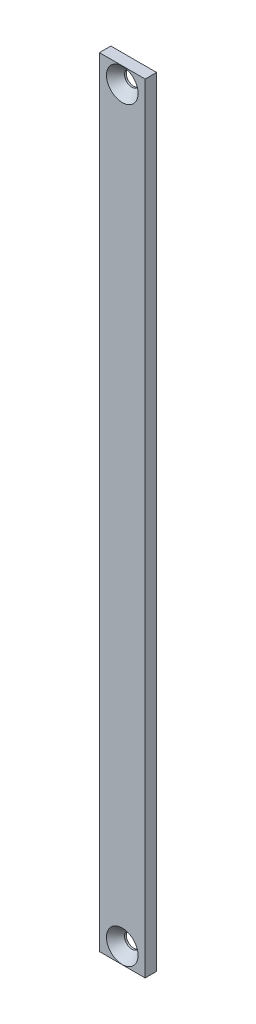
ISO-10303-21;
HEADER;
FILE_DESCRIPTION(('STEP AP214'),'2;1');
FILE_NAME('part.step','',(''),(''),'','','');
FILE_SCHEMA(('AUTOMOTIVE_DESIGN { 1 0 10303 214 1 1 1 1 }'));
ENDSEC;
DATA;
#1=APPLICATION_CONTEXT('core data for automotive mechanical design processes');
#2=APPLICATION_PROTOCOL_DEFINITION('international standard','automotive_design',2000,#1);
#3=PRODUCT_CONTEXT('',#1,'mechanical');
#4=PRODUCT('Part','Part','',(#3));
#5=PRODUCT_RELATED_PRODUCT_CATEGORY('part','',(#4));
#6=PRODUCT_DEFINITION_FORMATION('','',#4);
#7=PRODUCT_DEFINITION_CONTEXT('part definition',#1,'design');
#8=PRODUCT_DEFINITION('design','',#6,#7);
#9=PRODUCT_DEFINITION_SHAPE('','',#8);
#10=(LENGTH_UNIT() NAMED_UNIT(*) SI_UNIT(.MILLI.,.METRE.));
#11=(NAMED_UNIT(*) PLANE_ANGLE_UNIT() SI_UNIT($,.RADIAN.));
#12=(NAMED_UNIT(*) SI_UNIT($,.STERADIAN.) SOLID_ANGLE_UNIT());
#13=UNCERTAINTY_MEASURE_WITH_UNIT(LENGTH_MEASURE(1.E-05),#10,'distance_accuracy_value','');
#14=(GEOMETRIC_REPRESENTATION_CONTEXT(3) GLOBAL_UNCERTAINTY_ASSIGNED_CONTEXT((#13)) GLOBAL_UNIT_ASSIGNED_CONTEXT((#10,
#11,#12)) REPRESENTATION_CONTEXT('',''));
#15=CARTESIAN_POINT('',(0.,0.,0.));
#16=DIRECTION('',(0.,0.,1.));
#17=DIRECTION('',(1.,0.,0.));
#18=AXIS2_PLACEMENT_3D('',#15,#16,#17);
#19=CARTESIAN_POINT('',(-54.1349477888952,215.986798779334,6.35));
#20=DIRECTION('',(1.,0.,0.));
#21=DIRECTION('',(0.,1.,0.));
#22=AXIS2_PLACEMENT_3D('',#19,#20,#21);
#23=PLANE('',#22);
#24=DIRECTION('',(0.,-1.,0.));
#25=VECTOR('',#24,1.);
#26=CARTESIAN_POINT('',(-54.1349477888952,215.986798779334,0.));
#27=LINE('',#26,#25);
#28=CARTESIAN_POINT('',(-54.1349477888952,215.986798779334,0.));
#29=VERTEX_POINT('',#28);
#30=CARTESIAN_POINT('',(-54.1349477888952,-215.986798779334,0.));
#31=VERTEX_POINT('',#30);
#32=EDGE_CURVE('E73',#29,#31,#27,.T.);
#33=ORIENTED_EDGE('',*,*,#32,.T.);
#34=DIRECTION('',(0.,0.,-1.));
#35=VECTOR('',#34,1.);
#36=CARTESIAN_POINT('',(-54.1349477888952,-215.986798779334,6.35));
#37=LINE('',#36,#35);
#38=CARTESIAN_POINT('',(-54.1349477888952,-215.986798779334,6.35));
#39=VERTEX_POINT('',#38);
#40=EDGE_CURVE('E11',#39,#31,#37,.T.);
#41=ORIENTED_EDGE('',*,*,#40,.F.);
#42=DIRECTION('',(0.,-1.,0.));
#43=VECTOR('',#42,1.);
#44=CARTESIAN_POINT('',(-54.1349477888952,215.986798779334,6.35));
#45=LINE('',#44,#43);
#46=CARTESIAN_POINT('',(-54.1349477888952,215.986798779334,6.35));
#47=VERTEX_POINT('',#46);
#48=EDGE_CURVE('E96',#47,#39,#45,.T.);
#49=ORIENTED_EDGE('',*,*,#48,.F.);
#50=DIRECTION('',(0.,0.,-1.));
#51=VECTOR('',#50,1.);
#52=CARTESIAN_POINT('',(-54.1349477888952,215.986798779334,6.35));
#53=LINE('',#52,#51);
#54=EDGE_CURVE('E85',#47,#29,#53,.T.);
#55=ORIENTED_EDGE('',*,*,#54,.T.);
#56=EDGE_LOOP('',(#33,#41,#49,#55));
#57=FACE_BOUND('',#56,.T.);
#58=ADVANCED_FACE('F29',(#57),#23,.F.);
#59=CARTESIAN_POINT('',(-54.1349477888952,-215.986798779334,6.35));
#60=DIRECTION('',(0.,1.,0.));
#61=DIRECTION('',(0.,0.,1.));
#62=AXIS2_PLACEMENT_3D('',#59,#60,#61);
#63=PLANE('',#62);
#64=DIRECTION('',(1.,0.,0.));
#65=VECTOR('',#64,1.);
#66=CARTESIAN_POINT('',(-54.1349477888952,-215.986798779334,0.));
#67=LINE('',#66,#65);
#68=CARTESIAN_POINT('',(-28.7349477888952,-215.986798779334,0.));
#69=VERTEX_POINT('',#68);
#70=EDGE_CURVE('E69',#31,#69,#67,.T.);
#71=ORIENTED_EDGE('',*,*,#70,.T.);
#72=DIRECTION('',(0.,0.,-1.));
#73=VECTOR('',#72,1.);
#74=CARTESIAN_POINT('',(-28.7349477888952,-215.986798779334,6.35));
#75=LINE('',#74,#73);
#76=CARTESIAN_POINT('',(-28.7349477888952,-215.986798779334,6.35));
#77=VERTEX_POINT('',#76);
#78=EDGE_CURVE('E36',#77,#69,#75,.T.);
#79=ORIENTED_EDGE('',*,*,#78,.F.);
#80=DIRECTION('',(1.,0.,0.));
#81=VECTOR('',#80,1.);
#82=CARTESIAN_POINT('',(-54.1349477888952,-215.986798779334,6.35));
#83=LINE('',#82,#81);
#84=EDGE_CURVE('E81',#39,#77,#83,.T.);
#85=ORIENTED_EDGE('',*,*,#84,.F.);
#86=ORIENTED_EDGE('',*,*,#40,.T.);
#87=EDGE_LOOP('',(#71,#79,#85,#86));
#88=FACE_BOUND('',#87,.T.);
#89=ADVANCED_FACE('F80',(#88),#63,.F.);
#90=CARTESIAN_POINT('',(-28.7349477888951,215.986798779334,6.35));
#91=DIRECTION('',(-1.,0.,0.));
#92=DIRECTION('',(0.,-1.,0.));
#93=AXIS2_PLACEMENT_3D('',#90,#91,#92);
#94=PLANE('',#93);
#95=DIRECTION('',(0.,1.,0.));
#96=VECTOR('',#95,1.);
#97=CARTESIAN_POINT('',(-28.7349477888951,215.986798779334,0.));
#98=LINE('',#97,#96);
#99=CARTESIAN_POINT('',(-28.7349477888951,215.986798779334,0.));
#100=VERTEX_POINT('',#99);
#101=EDGE_CURVE('E74',#69,#100,#98,.T.);
#102=ORIENTED_EDGE('',*,*,#101,.T.);
#103=DIRECTION('',(0.,0.,-1.));
#104=VECTOR('',#103,1.);
#105=CARTESIAN_POINT('',(-28.7349477888951,215.986798779334,6.35));
#106=LINE('',#105,#104);
#107=CARTESIAN_POINT('',(-28.7349477888951,215.986798779334,6.35));
#108=VERTEX_POINT('',#107);
#109=EDGE_CURVE('E102',#108,#100,#106,.T.);
#110=ORIENTED_EDGE('',*,*,#109,.F.);
#111=DIRECTION('',(0.,1.,0.));
#112=VECTOR('',#111,1.);
#113=CARTESIAN_POINT('',(-28.7349477888951,215.986798779334,6.35));
#114=LINE('',#113,#112);
#115=EDGE_CURVE('E48',#77,#108,#114,.T.);
#116=ORIENTED_EDGE('',*,*,#115,.F.);
#117=ORIENTED_EDGE('',*,*,#78,.T.);
#118=EDGE_LOOP('',(#102,#110,#116,#117));
#119=FACE_BOUND('',#118,.T.);
#120=ADVANCED_FACE('F105',(#119),#94,.F.);
#121=CARTESIAN_POINT('',(-54.1349477888952,215.986798779334,6.35));
#122=DIRECTION('',(0.,-1.,0.));
#123=DIRECTION('',(0.,0.,-1.));
#124=AXIS2_PLACEMENT_3D('',#121,#122,#123);
#125=PLANE('',#124);
#126=DIRECTION('',(-1.,0.,0.));
#127=VECTOR('',#126,1.);
#128=CARTESIAN_POINT('',(-54.1349477888952,215.986798779334,0.));
#129=LINE('',#128,#127);
#130=EDGE_CURVE('E94',#100,#29,#129,.T.);
#131=ORIENTED_EDGE('',*,*,#130,.T.);
#132=ORIENTED_EDGE('',*,*,#54,.F.);
#133=DIRECTION('',(-1.,0.,0.));
#134=VECTOR('',#133,1.);
#135=CARTESIAN_POINT('',(-54.1349477888952,215.986798779334,6.35));
#136=LINE('',#135,#134);
#137=EDGE_CURVE('E43',#108,#47,#136,.T.);
#138=ORIENTED_EDGE('',*,*,#137,.F.);
#139=ORIENTED_EDGE('',*,*,#109,.T.);
#140=EDGE_LOOP('',(#131,#132,#138,#139));
#141=FACE_BOUND('',#140,.T.);
#142=ADVANCED_FACE('F107',(#141),#125,.F.);
#143=CARTESIAN_POINT('',(-54.1349477888952,215.986798779334,6.35));
#144=DIRECTION('',(0.,0.,1.));
#145=DIRECTION('',(1.,0.,0.));
#146=AXIS2_PLACEMENT_3D('',#143,#144,#145);
#147=PLANE('',#146);
#148=CARTESIAN_POINT('',(-41.4349477888952,207.096798779334,6.35));
#149=DIRECTION('',(0.,0.,1.));
#150=DIRECTION('',(1.,0.,0.));
#151=AXIS2_PLACEMENT_3D('',#148,#149,#150);
#152=CIRCLE('',#151,8.7727917);
#153=CARTESIAN_POINT('',(-32.6621560888952,207.096798779334,6.35));
#154=VERTEX_POINT('',#153);
#155=EDGE_CURVE('E180',#154,#154,#152,.T.);
#156=ORIENTED_EDGE('',*,*,#155,.F.);
#157=EDGE_LOOP('',(#156));
#158=FACE_BOUND('',#157,.T.);
#159=CARTESIAN_POINT('',(-41.4349477888952,-207.096798779334,6.35));
#160=DIRECTION('',(0.,0.,1.));
#161=DIRECTION('',(1.,0.,0.));
#162=AXIS2_PLACEMENT_3D('',#159,#160,#161);
#163=CIRCLE('',#162,8.7727917);
#164=CARTESIAN_POINT('',(-32.6621560888952,-207.096798779334,6.35));
#165=VERTEX_POINT('',#164);
#166=EDGE_CURVE('E187',#165,#165,#163,.T.);
#167=ORIENTED_EDGE('',*,*,#166,.F.);
#168=EDGE_LOOP('',(#167));
#169=FACE_BOUND('',#168,.T.);
#170=ORIENTED_EDGE('',*,*,#48,.T.);
#171=ORIENTED_EDGE('',*,*,#84,.T.);
#172=ORIENTED_EDGE('',*,*,#115,.T.);
#173=ORIENTED_EDGE('',*,*,#137,.T.);
#174=EDGE_LOOP('',(#170,#171,#172,#173));
#175=FACE_BOUND('',#174,.T.);
#176=ADVANCED_FACE('F108',(#158,#169,#175),#147,.T.);
#177=CARTESIAN_POINT('',(-54.1349477888952,215.986798779334,0.));
#178=DIRECTION('',(0.,0.,1.));
#179=DIRECTION('',(1.,0.,0.));
#180=AXIS2_PLACEMENT_3D('',#177,#178,#179);
#181=PLANE('',#180);
#182=CARTESIAN_POINT('',(-41.4349477888952,207.096798779334,0.));
#183=DIRECTION('',(0.,0.,1.));
#184=DIRECTION('',(1.,0.,0.));
#185=AXIS2_PLACEMENT_3D('',#182,#183,#184);
#186=CIRCLE('',#185,4.10209999999999);
#187=CARTESIAN_POINT('',(-37.3328477888952,207.096798779334,0.));
#188=VERTEX_POINT('',#187);
#189=EDGE_CURVE('E182',#188,#188,#186,.T.);
#190=ORIENTED_EDGE('',*,*,#189,.T.);
#191=EDGE_LOOP('',(#190));
#192=FACE_BOUND('',#191,.T.);
#193=CARTESIAN_POINT('',(-41.4349477888952,-207.096798779334,0.));
#194=DIRECTION('',(0.,0.,1.));
#195=DIRECTION('',(1.,0.,0.));
#196=AXIS2_PLACEMENT_3D('',#193,#194,#195);
#197=CIRCLE('',#196,4.10209999999999);
#198=CARTESIAN_POINT('',(-37.3328477888952,-207.096798779334,0.));
#199=VERTEX_POINT('',#198);
#200=EDGE_CURVE('E86',#199,#199,#197,.T.);
#201=ORIENTED_EDGE('',*,*,#200,.T.);
#202=EDGE_LOOP('',(#201));
#203=FACE_BOUND('',#202,.T.);
#204=ORIENTED_EDGE('',*,*,#32,.F.);
#205=ORIENTED_EDGE('',*,*,#130,.F.);
#206=ORIENTED_EDGE('',*,*,#101,.F.);
#207=ORIENTED_EDGE('',*,*,#70,.F.);
#208=EDGE_LOOP('',(#204,#205,#206,#207));
#209=FACE_BOUND('',#208,.T.);
#210=ADVANCED_FACE('F70',(#192,#203,#209),#181,.F.);
#211=CARTESIAN_POINT('',(-41.4349477888952,-207.096798779334,6.35));
#212=DIRECTION('',(0.,0.,1.));
#213=DIRECTION('',(1.,0.,0.));
#214=AXIS2_PLACEMENT_3D('',#211,#212,#213);
#215=CYLINDRICAL_SURFACE('',#214,4.10209999999999);
#216=ORIENTED_EDGE('',*,*,#200,.F.);
#217=EDGE_LOOP('',(#216));
#218=FACE_BOUND('',#217,.T.);
#219=CARTESIAN_POINT('',(-41.4349477888952,-207.096798779334,0.976983828450592));
#220=DIRECTION('',(0.,0.,1.));
#221=DIRECTION('',(1.,0.,0.));
#222=AXIS2_PLACEMENT_3D('',#219,#220,#221);
#223=CIRCLE('',#222,4.10209999999999);
#224=CARTESIAN_POINT('',(-37.3328477888952,-207.096798779334,0.976983828450592));
#225=VERTEX_POINT('',#224);
#226=EDGE_CURVE('E89',#225,#225,#223,.T.);
#227=ORIENTED_EDGE('',*,*,#226,.T.);
#228=EDGE_LOOP('',(#227));
#229=FACE_BOUND('',#228,.T.);
#230=ADVANCED_FACE('F116',(#218,#229),#215,.F.);
#231=CARTESIAN_POINT('',(-41.4349477888952,-207.096798779334,6.35));
#232=DIRECTION('',(0.,0.,1.));
#233=DIRECTION('',(1.,0.,0.));
#234=AXIS2_PLACEMENT_3D('',#231,#232,#233);
#235=CONICAL_SURFACE('',#234,8.7727917,0.715584993317674);
#236=ORIENTED_EDGE('',*,*,#226,.F.);
#237=EDGE_LOOP('',(#236));
#238=FACE_BOUND('',#237,.T.);
#239=ORIENTED_EDGE('',*,*,#166,.T.);
#240=EDGE_LOOP('',(#239));
#241=FACE_BOUND('',#240,.T.);
#242=ADVANCED_FACE('F149',(#238,#241),#235,.F.);
#243=CARTESIAN_POINT('',(-41.4349477888952,207.096798779334,6.35));
#244=DIRECTION('',(0.,0.,1.));
#245=DIRECTION('',(1.,0.,0.));
#246=AXIS2_PLACEMENT_3D('',#243,#244,#245);
#247=CYLINDRICAL_SURFACE('',#246,4.10209999999999);
#248=ORIENTED_EDGE('',*,*,#189,.F.);
#249=EDGE_LOOP('',(#248));
#250=FACE_BOUND('',#249,.T.);
#251=CARTESIAN_POINT('',(-41.4349477888952,207.096798779334,0.976983828450592));
#252=DIRECTION('',(0.,0.,1.));
#253=DIRECTION('',(1.,0.,0.));
#254=AXIS2_PLACEMENT_3D('',#251,#252,#253);
#255=CIRCLE('',#254,4.10209999999999);
#256=CARTESIAN_POINT('',(-37.3328477888952,207.096798779334,0.976983828450592));
#257=VERTEX_POINT('',#256);
#258=EDGE_CURVE('E178',#257,#257,#255,.T.);
#259=ORIENTED_EDGE('',*,*,#258,.T.);
#260=EDGE_LOOP('',(#259));
#261=FACE_BOUND('',#260,.T.);
#262=ADVANCED_FACE('F157',(#250,#261),#247,.F.);
#263=CARTESIAN_POINT('',(-41.4349477888952,207.096798779334,6.35));
#264=DIRECTION('',(0.,0.,1.));
#265=DIRECTION('',(1.,0.,0.));
#266=AXIS2_PLACEMENT_3D('',#263,#264,#265);
#267=CONICAL_SURFACE('',#266,8.7727917,0.715584993317674);
#268=ORIENTED_EDGE('',*,*,#258,.F.);
#269=EDGE_LOOP('',(#268));
#270=FACE_BOUND('',#269,.T.);
#271=ORIENTED_EDGE('',*,*,#155,.T.);
#272=EDGE_LOOP('',(#271));
#273=FACE_BOUND('',#272,.T.);
#274=ADVANCED_FACE('F165',(#270,#273),#267,.F.);
#275=CLOSED_SHELL('',(#58,#89,#120,#142,#176,#210,#230,#242,#262,#274));
#276=MANIFOLD_SOLID_BREP('B2',#275);
#277=ADVANCED_BREP_SHAPE_REPRESENTATION('',(#18,#276),#14);
#278=SHAPE_DEFINITION_REPRESENTATION(#9,#277);
ENDSEC;
END-ISO-10303-21;
